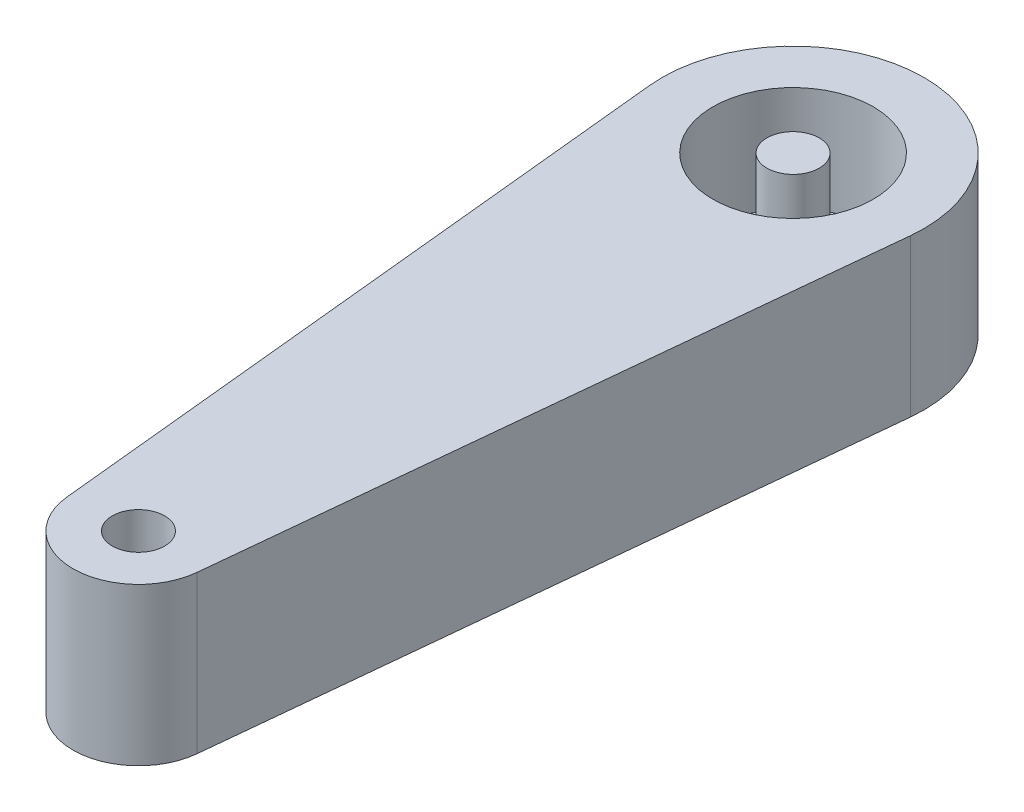
ISO-10303-21;
HEADER;
FILE_DESCRIPTION(('STEP AP214'),'2;1');
FILE_NAME('part.step','',(''),(''),'','','');
FILE_SCHEMA(('AUTOMOTIVE_DESIGN { 1 0 10303 214 1 1 1 1 }'));
ENDSEC;
DATA;
#1=APPLICATION_CONTEXT('core data for automotive mechanical design processes');
#2=APPLICATION_PROTOCOL_DEFINITION('international standard','automotive_design',2000,#1);
#3=PRODUCT_CONTEXT('',#1,'mechanical');
#4=PRODUCT('Part','Part','',(#3));
#5=PRODUCT_RELATED_PRODUCT_CATEGORY('part','',(#4));
#6=PRODUCT_DEFINITION_FORMATION('','',#4);
#7=PRODUCT_DEFINITION_CONTEXT('part definition',#1,'design');
#8=PRODUCT_DEFINITION('design','',#6,#7);
#9=PRODUCT_DEFINITION_SHAPE('','',#8);
#10=(LENGTH_UNIT() NAMED_UNIT(*) SI_UNIT(.MILLI.,.METRE.));
#11=(NAMED_UNIT(*) PLANE_ANGLE_UNIT() SI_UNIT($,.RADIAN.));
#12=(NAMED_UNIT(*) SI_UNIT($,.STERADIAN.) SOLID_ANGLE_UNIT());
#13=UNCERTAINTY_MEASURE_WITH_UNIT(LENGTH_MEASURE(1.E-05),#10,'distance_accuracy_value','');
#14=(GEOMETRIC_REPRESENTATION_CONTEXT(3) GLOBAL_UNCERTAINTY_ASSIGNED_CONTEXT((#13)) GLOBAL_UNIT_ASSIGNED_CONTEXT((#10,
#11,#12)) REPRESENTATION_CONTEXT('',''));
#15=CARTESIAN_POINT('',(0.,0.,0.));
#16=DIRECTION('',(0.,0.,1.));
#17=DIRECTION('',(1.,0.,0.));
#18=AXIS2_PLACEMENT_3D('',#15,#16,#17);
#19=CARTESIAN_POINT('',(-5.1,-31.4,0.));
#20=DIRECTION('',(0.,1.,0.));
#21=DIRECTION('',(0.,0.,1.));
#22=AXIS2_PLACEMENT_3D('',#19,#20,#21);
#23=CYLINDRICAL_SURFACE('',#22,2.45);
#24=CARTESIAN_POINT('',(-5.1,-26.6,0.));
#25=DIRECTION('',(0.,-1.,0.));
#26=DIRECTION('',(0.,0.,-1.));
#27=AXIS2_PLACEMENT_3D('',#24,#25,#26);
#28=CIRCLE('',#27,2.45);
#29=CARTESIAN_POINT('',(-5.1,-26.6,-2.45));
#30=VERTEX_POINT('',#29);
#31=EDGE_CURVE('E11',#30,#30,#28,.T.);
#32=ORIENTED_EDGE('',*,*,#31,.F.);
#33=EDGE_LOOP('',(#32));
#34=FACE_BOUND('',#33,.T.);
#35=CARTESIAN_POINT('',(-5.1,-29.8,0.));
#36=DIRECTION('',(0.,-1.,0.));
#37=DIRECTION('',(0.,0.,-1.));
#38=AXIS2_PLACEMENT_3D('',#35,#36,#37);
#39=CIRCLE('',#38,2.45);
#40=CARTESIAN_POINT('',(-5.1,-29.8,-2.45));
#41=VERTEX_POINT('',#40);
#42=EDGE_CURVE('E25',#41,#41,#39,.T.);
#43=ORIENTED_EDGE('',*,*,#42,.T.);
#44=EDGE_LOOP('',(#43));
#45=FACE_BOUND('',#44,.T.);
#46=ADVANCED_FACE('F17',(#34,#45),#23,.F.);
#47=CARTESIAN_POINT('',(-8.08496231131986,-31.4,10.3));
#48=DIRECTION('',(-0.99498743710662,0.,0.1));
#49=DIRECTION('',(0.1,0.,0.99498743710662));
#50=AXIS2_PLACEMENT_3D('',#47,#48,#49);
#51=PLANE('',#50);
#52=DIRECTION('',(0.1,0.,0.99498743710662));
#53=VECTOR('',#52,1.);
#54=CARTESIAN_POINT('',(-8.08496231131986,-26.6,10.3));
#55=LINE('',#54,#53);
#56=CARTESIAN_POINT('',(-9.07994974842648,-26.6,0.4));
#57=VERTEX_POINT('',#56);
#58=CARTESIAN_POINT('',(-7.08997487421324,-26.6,20.2));
#59=VERTEX_POINT('',#58);
#60=EDGE_CURVE('E32',#57,#59,#55,.T.);
#61=ORIENTED_EDGE('',*,*,#60,.F.);
#62=DIRECTION('',(0.,1.,0.));
#63=VECTOR('',#62,1.);
#64=CARTESIAN_POINT('',(-9.07994974842648,-31.4,0.4));
#65=LINE('',#64,#63);
#66=CARTESIAN_POINT('',(-9.07994974842648,-31.4,0.4));
#67=VERTEX_POINT('',#66);
#68=EDGE_CURVE('E36',#67,#57,#65,.T.);
#69=ORIENTED_EDGE('',*,*,#68,.F.);
#70=DIRECTION('',(0.1,0.,0.99498743710662));
#71=VECTOR('',#70,1.);
#72=CARTESIAN_POINT('',(-8.08496231131986,-31.4,10.3));
#73=LINE('',#72,#71);
#74=CARTESIAN_POINT('',(-7.08997487421324,-31.4,20.2));
#75=VERTEX_POINT('',#74);
#76=EDGE_CURVE('E106',#67,#75,#73,.T.);
#77=ORIENTED_EDGE('',*,*,#76,.T.);
#78=DIRECTION('',(0.,1.,0.));
#79=VECTOR('',#78,1.);
#80=CARTESIAN_POINT('',(-7.08997487421324,-31.4,20.2));
#81=LINE('',#80,#79);
#82=EDGE_CURVE('E74',#75,#59,#81,.T.);
#83=ORIENTED_EDGE('',*,*,#82,.T.);
#84=EDGE_LOOP('',(#61,#69,#77,#83));
#85=FACE_BOUND('',#84,.T.);
#86=ADVANCED_FACE('F152',(#85),#51,.T.);
#87=CARTESIAN_POINT('',(-5.1,-31.4,0.));
#88=DIRECTION('',(0.,1.,0.));
#89=DIRECTION('',(0.,0.,1.));
#90=AXIS2_PLACEMENT_3D('',#87,#88,#89);
#91=CYLINDRICAL_SURFACE('',#90,4.);
#92=CARTESIAN_POINT('',(-5.1,-26.6,0.));
#93=DIRECTION('',(0.,-1.,0.));
#94=DIRECTION('',(0.,0.,-1.));
#95=AXIS2_PLACEMENT_3D('',#92,#93,#94);
#96=CIRCLE('',#95,4.);
#97=CARTESIAN_POINT('',(-1.12005025157352,-26.6,0.399999999999992));
#98=VERTEX_POINT('',#97);
#99=EDGE_CURVE('E102',#57,#98,#96,.T.);
#100=ORIENTED_EDGE('',*,*,#99,.T.);
#101=DIRECTION('',(0.,1.,0.));
#102=VECTOR('',#101,1.);
#103=CARTESIAN_POINT('',(-1.12005025157352,-31.4,0.399999999999992));
#104=LINE('',#103,#102);
#105=CARTESIAN_POINT('',(-1.12005025157352,-31.4,0.399999999999992));
#106=VERTEX_POINT('',#105);
#107=EDGE_CURVE('E99',#106,#98,#104,.T.);
#108=ORIENTED_EDGE('',*,*,#107,.F.);
#109=CARTESIAN_POINT('',(-5.1,-31.4,0.));
#110=DIRECTION('',(0.,-1.,0.));
#111=DIRECTION('',(0.,0.,-1.));
#112=AXIS2_PLACEMENT_3D('',#109,#110,#111);
#113=CIRCLE('',#112,4.);
#114=EDGE_CURVE('E83',#67,#106,#113,.T.);
#115=ORIENTED_EDGE('',*,*,#114,.F.);
#116=ORIENTED_EDGE('',*,*,#68,.T.);
#117=EDGE_LOOP('',(#100,#108,#115,#116));
#118=FACE_BOUND('',#117,.T.);
#119=ADVANCED_FACE('F149',(#118),#91,.T.);
#120=CARTESIAN_POINT('',(-2.11503768868014,-31.4,10.3));
#121=DIRECTION('',(-0.99498743710662,0.,-0.1));
#122=DIRECTION('',(-0.1,0.,0.99498743710662));
#123=AXIS2_PLACEMENT_3D('',#120,#121,#122);
#124=PLANE('',#123);
#125=DIRECTION('',(-0.1,0.,0.99498743710662));
#126=VECTOR('',#125,1.);
#127=CARTESIAN_POINT('',(-2.11503768868014,-26.6,10.3));
#128=LINE('',#127,#126);
#129=CARTESIAN_POINT('',(-3.11002512578676,-26.6,20.2));
#130=VERTEX_POINT('',#129);
#131=EDGE_CURVE('E64',#98,#130,#128,.T.);
#132=ORIENTED_EDGE('',*,*,#131,.T.);
#133=DIRECTION('',(0.,1.,0.));
#134=VECTOR('',#133,1.);
#135=CARTESIAN_POINT('',(-3.11002512578676,-31.4,20.2));
#136=LINE('',#135,#134);
#137=CARTESIAN_POINT('',(-3.11002512578676,-31.4,20.2));
#138=VERTEX_POINT('',#137);
#139=EDGE_CURVE('E56',#138,#130,#136,.T.);
#140=ORIENTED_EDGE('',*,*,#139,.F.);
#141=DIRECTION('',(-0.1,0.,0.99498743710662));
#142=VECTOR('',#141,1.);
#143=CARTESIAN_POINT('',(-2.11503768868014,-31.4,10.3));
#144=LINE('',#143,#142);
#145=EDGE_CURVE('E61',#106,#138,#144,.T.);
#146=ORIENTED_EDGE('',*,*,#145,.F.);
#147=ORIENTED_EDGE('',*,*,#107,.T.);
#148=EDGE_LOOP('',(#132,#140,#146,#147));
#149=FACE_BOUND('',#148,.T.);
#150=ADVANCED_FACE('F58',(#149),#124,.F.);
#151=CARTESIAN_POINT('',(-5.1,-31.4,20.));
#152=DIRECTION('',(0.,1.,0.));
#153=DIRECTION('',(0.,0.,1.));
#154=AXIS2_PLACEMENT_3D('',#151,#152,#153);
#155=CYLINDRICAL_SURFACE('',#154,0.8);
#156=CARTESIAN_POINT('',(-5.1,-31.4,20.));
#157=DIRECTION('',(0.,-1.,0.));
#158=DIRECTION('',(0.,0.,-1.));
#159=AXIS2_PLACEMENT_3D('',#156,#157,#158);
#160=CIRCLE('',#159,0.8);
#161=CARTESIAN_POINT('',(-5.1,-31.4,19.2));
#162=VERTEX_POINT('',#161);
#163=EDGE_CURVE('E85',#162,#162,#160,.T.);
#164=ORIENTED_EDGE('',*,*,#163,.T.);
#165=EDGE_LOOP('',(#164));
#166=FACE_BOUND('',#165,.T.);
#167=CARTESIAN_POINT('',(-5.1,-26.6,20.));
#168=DIRECTION('',(0.,-1.,0.));
#169=DIRECTION('',(0.,0.,-1.));
#170=AXIS2_PLACEMENT_3D('',#167,#168,#169);
#171=CIRCLE('',#170,0.8);
#172=CARTESIAN_POINT('',(-5.1,-26.6,19.2));
#173=VERTEX_POINT('',#172);
#174=EDGE_CURVE('E91',#173,#173,#171,.T.);
#175=ORIENTED_EDGE('',*,*,#174,.F.);
#176=EDGE_LOOP('',(#175));
#177=FACE_BOUND('',#176,.T.);
#178=ADVANCED_FACE('F140',(#166,#177),#155,.F.);
#179=CARTESIAN_POINT('',(-5.1,-31.4,20.));
#180=DIRECTION('',(0.,1.,0.));
#181=DIRECTION('',(0.,0.,1.));
#182=AXIS2_PLACEMENT_3D('',#179,#180,#181);
#183=CYLINDRICAL_SURFACE('',#182,2.);
#184=CARTESIAN_POINT('',(-5.1,-26.6,20.));
#185=DIRECTION('',(0.,-1.,0.));
#186=DIRECTION('',(0.,0.,-1.));
#187=AXIS2_PLACEMENT_3D('',#184,#185,#186);
#188=CIRCLE('',#187,2.);
#189=EDGE_CURVE('E78',#130,#59,#188,.T.);
#190=ORIENTED_EDGE('',*,*,#189,.T.);
#191=ORIENTED_EDGE('',*,*,#82,.F.);
#192=CARTESIAN_POINT('',(-5.1,-31.4,20.));
#193=DIRECTION('',(0.,-1.,0.));
#194=DIRECTION('',(0.,0.,-1.));
#195=AXIS2_PLACEMENT_3D('',#192,#193,#194);
#196=CIRCLE('',#195,2.);
#197=EDGE_CURVE('E72',#138,#75,#196,.T.);
#198=ORIENTED_EDGE('',*,*,#197,.F.);
#199=ORIENTED_EDGE('',*,*,#139,.T.);
#200=EDGE_LOOP('',(#190,#191,#198,#199));
#201=FACE_BOUND('',#200,.T.);
#202=ADVANCED_FACE('F73',(#201),#183,.T.);
#203=CARTESIAN_POINT('',(-3.9,-31.4,7.975));
#204=DIRECTION('',(0.,-1.,0.));
#205=DIRECTION('',(1.,0.,0.));
#206=AXIS2_PLACEMENT_3D('',#203,#204,#205);
#207=PLANE('',#206);
#208=ORIENTED_EDGE('',*,*,#76,.F.);
#209=ORIENTED_EDGE('',*,*,#114,.T.);
#210=ORIENTED_EDGE('',*,*,#145,.T.);
#211=ORIENTED_EDGE('',*,*,#197,.T.);
#212=EDGE_LOOP('',(#208,#209,#210,#211));
#213=FACE_BOUND('',#212,.T.);
#214=ORIENTED_EDGE('',*,*,#163,.F.);
#215=EDGE_LOOP('',(#214));
#216=FACE_BOUND('',#215,.T.);
#217=ADVANCED_FACE('F81',(#213,#216),#207,.T.);
#218=CARTESIAN_POINT('',(-3.9,-26.6,7.975));
#219=DIRECTION('',(0.,-1.,0.));
#220=DIRECTION('',(1.,0.,0.));
#221=AXIS2_PLACEMENT_3D('',#218,#219,#220);
#222=PLANE('',#221);
#223=ORIENTED_EDGE('',*,*,#60,.T.);
#224=ORIENTED_EDGE('',*,*,#189,.F.);
#225=ORIENTED_EDGE('',*,*,#131,.F.);
#226=ORIENTED_EDGE('',*,*,#99,.F.);
#227=EDGE_LOOP('',(#223,#224,#225,#226));
#228=FACE_BOUND('',#227,.T.);
#229=ORIENTED_EDGE('',*,*,#174,.T.);
#230=EDGE_LOOP('',(#229));
#231=FACE_BOUND('',#230,.T.);
#232=ORIENTED_EDGE('',*,*,#31,.T.);
#233=EDGE_LOOP('',(#232));
#234=FACE_BOUND('',#233,.T.);
#235=ADVANCED_FACE('F137',(#228,#231,#234),#222,.F.);
#236=CARTESIAN_POINT('',(-5.1,-31.402,0.));
#237=DIRECTION('',(0.,1.,0.));
#238=DIRECTION('',(0.,0.,1.));
#239=AXIS2_PLACEMENT_3D('',#236,#237,#238);
#240=CYLINDRICAL_SURFACE('',#239,0.8);
#241=CARTESIAN_POINT('',(-5.1,-26.6,0.));
#242=DIRECTION('',(0.,-1.,0.));
#243=DIRECTION('',(0.,0.,-1.));
#244=AXIS2_PLACEMENT_3D('',#241,#242,#243);
#245=CIRCLE('',#244,0.8);
#246=CARTESIAN_POINT('',(-5.1,-26.6,-0.8));
#247=VERTEX_POINT('',#246);
#248=EDGE_CURVE('E79',#247,#247,#245,.F.);
#249=ORIENTED_EDGE('',*,*,#248,.F.);
#250=EDGE_LOOP('',(#249));
#251=FACE_BOUND('',#250,.T.);
#252=CARTESIAN_POINT('',(-5.1,-29.8,0.));
#253=DIRECTION('',(0.,-1.,0.));
#254=DIRECTION('',(0.,0.,-1.));
#255=AXIS2_PLACEMENT_3D('',#252,#253,#254);
#256=CIRCLE('',#255,0.8);
#257=CARTESIAN_POINT('',(-5.1,-29.8,-0.8));
#258=VERTEX_POINT('',#257);
#259=EDGE_CURVE('E124',#258,#258,#256,.T.);
#260=ORIENTED_EDGE('',*,*,#259,.F.);
#261=EDGE_LOOP('',(#260));
#262=FACE_BOUND('',#261,.T.);
#263=ADVANCED_FACE('F158',(#251,#262),#240,.T.);
#264=CARTESIAN_POINT('',(0.65,-26.6,0.));
#265=DIRECTION('',(0.,-1.,0.));
#266=DIRECTION('',(0.,0.,-1.));
#267=AXIS2_PLACEMENT_3D('',#264,#265,#266);
#268=PLANE('',#267);
#269=ORIENTED_EDGE('',*,*,#248,.T.);
#270=EDGE_LOOP('',(#269));
#271=FACE_BOUND('',#270,.T.);
#272=ADVANCED_FACE('F120',(#271),#268,.F.);
#273=CARTESIAN_POINT('',(-5.1,-29.8,0.));
#274=DIRECTION('',(0.,-1.,0.));
#275=DIRECTION('',(0.,0.,-1.));
#276=AXIS2_PLACEMENT_3D('',#273,#274,#275);
#277=PLANE('',#276);
#278=ORIENTED_EDGE('',*,*,#42,.F.);
#279=EDGE_LOOP('',(#278));
#280=FACE_BOUND('',#279,.T.);
#281=ORIENTED_EDGE('',*,*,#259,.T.);
#282=EDGE_LOOP('',(#281));
#283=FACE_BOUND('',#282,.T.);
#284=ADVANCED_FACE('F117',(#280,#283),#277,.F.);
#285=CLOSED_SHELL('',(#46,#86,#119,#150,#178,#202,#217,#235,#263,#272,#284));
#286=MANIFOLD_SOLID_BREP('B1',#285);
#287=ADVANCED_BREP_SHAPE_REPRESENTATION('',(#18,#286),#14);
#288=SHAPE_DEFINITION_REPRESENTATION(#9,#287);
ENDSEC;
END-ISO-10303-21;
